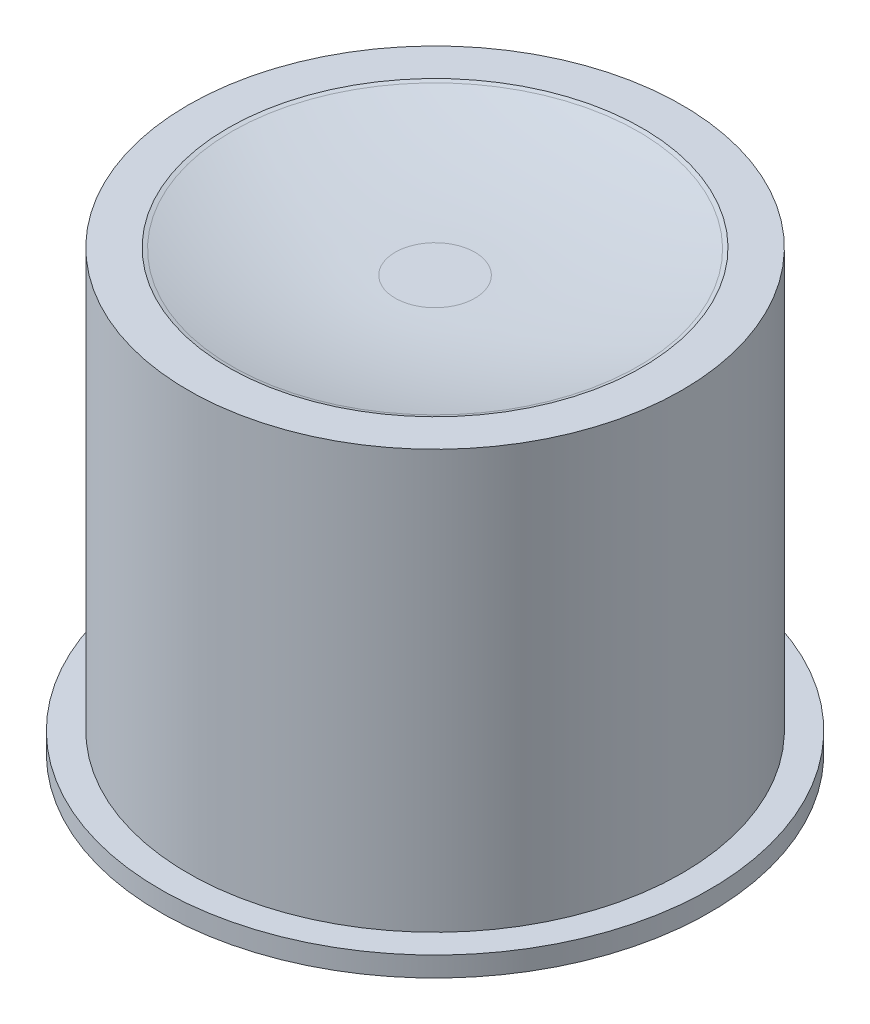
ISO-10303-21;
HEADER;
FILE_DESCRIPTION(('STEP AP214'),'2;1');
FILE_NAME('part.step','',(''),(''),'','','');
FILE_SCHEMA(('AUTOMOTIVE_DESIGN { 1 0 10303 214 1 1 1 1 }'));
ENDSEC;
DATA;
#1=APPLICATION_CONTEXT('core data for automotive mechanical design processes');
#2=APPLICATION_PROTOCOL_DEFINITION('international standard','automotive_design',2000,#1);
#3=PRODUCT_CONTEXT('',#1,'mechanical');
#4=PRODUCT('Part','Part','',(#3));
#5=PRODUCT_RELATED_PRODUCT_CATEGORY('part','',(#4));
#6=PRODUCT_DEFINITION_FORMATION('','',#4);
#7=PRODUCT_DEFINITION_CONTEXT('part definition',#1,'design');
#8=PRODUCT_DEFINITION('design','',#6,#7);
#9=PRODUCT_DEFINITION_SHAPE('','',#8);
#10=(LENGTH_UNIT() NAMED_UNIT(*) SI_UNIT(.MILLI.,.METRE.));
#11=(NAMED_UNIT(*) PLANE_ANGLE_UNIT() SI_UNIT($,.RADIAN.));
#12=(NAMED_UNIT(*) SI_UNIT($,.STERADIAN.) SOLID_ANGLE_UNIT());
#13=UNCERTAINTY_MEASURE_WITH_UNIT(LENGTH_MEASURE(1.E-05),#10,'distance_accuracy_value','');
#14=(GEOMETRIC_REPRESENTATION_CONTEXT(3) GLOBAL_UNCERTAINTY_ASSIGNED_CONTEXT((#13)) GLOBAL_UNIT_ASSIGNED_CONTEXT((#10,
#11,#12)) REPRESENTATION_CONTEXT('',''));
#15=CARTESIAN_POINT('',(0.,0.,0.));
#16=DIRECTION('',(0.,0.,1.));
#17=DIRECTION('',(1.,0.,0.));
#18=AXIS2_PLACEMENT_3D('',#15,#16,#17);
#19=CARTESIAN_POINT('',(0.,11.4003472180361,0.));
#20=DIRECTION('',(0.,1.,0.));
#21=DIRECTION('',(-1.,0.,0.));
#22=AXIS2_PLACEMENT_3D('',#19,#20,#21);
#23=PLANE('',#22);
#24=CARTESIAN_POINT('',(0.,11.4003472180361,0.));
#25=DIRECTION('',(0.,1.,0.));
#26=DIRECTION('',(-1.,0.,0.));
#27=AXIS2_PLACEMENT_3D('',#24,#25,#26);
#28=CIRCLE('',#27,0.999999999999999);
#29=CARTESIAN_POINT('',(-1.,11.4003472180361,0.));
#30=VERTEX_POINT('',#29);
#31=EDGE_CURVE('E76',#30,#30,#28,.T.);
#32=ORIENTED_EDGE('',*,*,#31,.T.);
#33=EDGE_LOOP('',(#32));
#34=FACE_BOUND('',#33,.T.);
#35=ADVANCED_FACE('F37',(#34),#23,.T.);
#36=CARTESIAN_POINT('',(-1.5,0.,0.));
#37=DIRECTION('',(0.,-1.,0.));
#38=DIRECTION('',(1.,0.,0.));
#39=AXIS2_PLACEMENT_3D('',#36,#37,#38);
#40=PLANE('',#39);
#41=CARTESIAN_POINT('',(0.,0.,0.));
#42=DIRECTION('',(0.,1.,0.));
#43=DIRECTION('',(-1.,0.,0.));
#44=AXIS2_PLACEMENT_3D('',#41,#42,#43);
#45=CIRCLE('',#44,1.5);
#46=CARTESIAN_POINT('',(-1.5,0.,0.));
#47=VERTEX_POINT('',#46);
#48=EDGE_CURVE('E10',#47,#47,#45,.T.);
#49=ORIENTED_EDGE('',*,*,#48,.F.);
#50=EDGE_LOOP('',(#49));
#51=FACE_BOUND('',#50,.T.);
#52=ADVANCED_FACE('F94',(#51),#40,.T.);
#53=CARTESIAN_POINT('',(0.,11.4003472180361,0.));
#54=DIRECTION('',(0.,1.,0.));
#55=DIRECTION('',(-1.,0.,0.));
#56=AXIS2_PLACEMENT_3D('',#53,#54,#55);
#57=CYLINDRICAL_SURFACE('',#56,1.5);
#58=ORIENTED_EDGE('',*,*,#48,.T.);
#59=EDGE_LOOP('',(#58));
#60=FACE_BOUND('',#59,.T.);
#61=CARTESIAN_POINT('',(0.,1.,0.));
#62=DIRECTION('',(0.,1.,0.));
#63=DIRECTION('',(-1.,0.,0.));
#64=AXIS2_PLACEMENT_3D('',#61,#62,#63);
#65=CIRCLE('',#64,1.5);
#66=CARTESIAN_POINT('',(-1.5,1.,0.));
#67=VERTEX_POINT('',#66);
#68=EDGE_CURVE('E44',#67,#67,#65,.T.);
#69=ORIENTED_EDGE('',*,*,#68,.F.);
#70=EDGE_LOOP('',(#69));
#71=FACE_BOUND('',#70,.T.);
#72=ADVANCED_FACE('F98',(#60,#71),#57,.T.);
#73=CARTESIAN_POINT('',(-6.2,1.,0.));
#74=DIRECTION('',(0.,-1.,0.));
#75=DIRECTION('',(1.,0.,0.));
#76=AXIS2_PLACEMENT_3D('',#73,#74,#75);
#77=PLANE('',#76);
#78=ORIENTED_EDGE('',*,*,#68,.T.);
#79=EDGE_LOOP('',(#78));
#80=FACE_BOUND('',#79,.T.);
#81=CARTESIAN_POINT('',(0.,1.,0.));
#82=DIRECTION('',(0.,1.,0.));
#83=DIRECTION('',(-1.,0.,0.));
#84=AXIS2_PLACEMENT_3D('',#81,#82,#83);
#85=CIRCLE('',#84,6.9);
#86=CARTESIAN_POINT('',(-6.9,1.,0.));
#87=VERTEX_POINT('',#86);
#88=EDGE_CURVE('E49',#87,#87,#85,.T.);
#89=ORIENTED_EDGE('',*,*,#88,.F.);
#90=EDGE_LOOP('',(#89));
#91=FACE_BOUND('',#90,.T.);
#92=ADVANCED_FACE('F103',(#80,#91),#77,.T.);
#93=CARTESIAN_POINT('',(0.,11.4003472180361,0.));
#94=DIRECTION('',(0.,1.,0.));
#95=DIRECTION('',(-1.,0.,0.));
#96=AXIS2_PLACEMENT_3D('',#93,#94,#95);
#97=CYLINDRICAL_SURFACE('',#96,6.9);
#98=ORIENTED_EDGE('',*,*,#88,.T.);
#99=EDGE_LOOP('',(#98));
#100=FACE_BOUND('',#99,.T.);
#101=CARTESIAN_POINT('',(0.,1.5,0.));
#102=DIRECTION('',(0.,1.,0.));
#103=DIRECTION('',(-1.,0.,0.));
#104=AXIS2_PLACEMENT_3D('',#101,#102,#103);
#105=CIRCLE('',#104,6.9);
#106=CARTESIAN_POINT('',(-6.9,1.5,0.));
#107=VERTEX_POINT('',#106);
#108=EDGE_CURVE('E54',#107,#107,#105,.T.);
#109=ORIENTED_EDGE('',*,*,#108,.F.);
#110=EDGE_LOOP('',(#109));
#111=FACE_BOUND('',#110,.T.);
#112=ADVANCED_FACE('F108',(#100,#111),#97,.T.);
#113=CARTESIAN_POINT('',(-6.9,1.5,0.));
#114=DIRECTION('',(0.,1.,0.));
#115=DIRECTION('',(-1.,0.,0.));
#116=AXIS2_PLACEMENT_3D('',#113,#114,#115);
#117=PLANE('',#116);
#118=ORIENTED_EDGE('',*,*,#108,.T.);
#119=EDGE_LOOP('',(#118));
#120=FACE_BOUND('',#119,.T.);
#121=CARTESIAN_POINT('',(0.,1.5,0.));
#122=DIRECTION('',(0.,1.,0.));
#123=DIRECTION('',(-1.,0.,0.));
#124=AXIS2_PLACEMENT_3D('',#121,#122,#123);
#125=CIRCLE('',#124,6.2);
#126=CARTESIAN_POINT('',(-6.2,1.5,0.));
#127=VERTEX_POINT('',#126);
#128=EDGE_CURVE('E60',#127,#127,#125,.T.);
#129=ORIENTED_EDGE('',*,*,#128,.F.);
#130=EDGE_LOOP('',(#129));
#131=FACE_BOUND('',#130,.T.);
#132=ADVANCED_FACE('F111',(#120,#131),#117,.T.);
#133=CARTESIAN_POINT('',(0.,11.4003472180361,0.));
#134=DIRECTION('',(0.,1.,0.));
#135=DIRECTION('',(-1.,0.,0.));
#136=AXIS2_PLACEMENT_3D('',#133,#134,#135);
#137=CYLINDRICAL_SURFACE('',#136,6.2);
#138=ORIENTED_EDGE('',*,*,#128,.T.);
#139=EDGE_LOOP('',(#138));
#140=FACE_BOUND('',#139,.T.);
#141=CARTESIAN_POINT('',(0.,12.,0.));
#142=DIRECTION('',(0.,1.,0.));
#143=DIRECTION('',(-1.,0.,0.));
#144=AXIS2_PLACEMENT_3D('',#141,#142,#143);
#145=CIRCLE('',#144,6.2);
#146=CARTESIAN_POINT('',(-6.2,12.,0.));
#147=VERTEX_POINT('',#146);
#148=EDGE_CURVE('E64',#147,#147,#145,.T.);
#149=ORIENTED_EDGE('',*,*,#148,.F.);
#150=EDGE_LOOP('',(#149));
#151=FACE_BOUND('',#150,.T.);
#152=ADVANCED_FACE('F115',(#140,#151),#137,.T.);
#153=CARTESIAN_POINT('',(-5.2,12.,0.));
#154=DIRECTION('',(0.,1.,0.));
#155=DIRECTION('',(-1.,0.,0.));
#156=AXIS2_PLACEMENT_3D('',#153,#154,#155);
#157=PLANE('',#156);
#158=ORIENTED_EDGE('',*,*,#148,.T.);
#159=EDGE_LOOP('',(#158));
#160=FACE_BOUND('',#159,.T.);
#161=CARTESIAN_POINT('',(0.,12.,0.));
#162=DIRECTION('',(0.,1.,0.));
#163=DIRECTION('',(-1.,0.,0.));
#164=AXIS2_PLACEMENT_3D('',#161,#162,#163);
#165=CIRCLE('',#164,5.2);
#166=CARTESIAN_POINT('',(-5.2,12.,0.));
#167=VERTEX_POINT('',#166);
#168=EDGE_CURVE('E68',#167,#167,#165,.T.);
#169=ORIENTED_EDGE('',*,*,#168,.F.);
#170=EDGE_LOOP('',(#169));
#171=FACE_BOUND('',#170,.T.);
#172=ADVANCED_FACE('F90',(#160,#171),#157,.T.);
#173=CARTESIAN_POINT('',(0.,11.9726412313772,0.));
#174=DIRECTION('',(0.,1.,0.));
#175=DIRECTION('',(-1.,0.,0.));
#176=AXIS2_PLACEMENT_3D('',#173,#174,#175);
#177=CONICAL_SURFACE('',#176,5.10381529342228,1.29367526674976);
#178=ORIENTED_EDGE('',*,*,#168,.T.);
#179=EDGE_LOOP('',(#178));
#180=FACE_BOUND('',#179,.T.);
#181=CARTESIAN_POINT('',(0.,11.9726412313772,0.));
#182=DIRECTION('',(0.,1.,0.));
#183=DIRECTION('',(-1.,0.,0.));
#184=AXIS2_PLACEMENT_3D('',#181,#182,#183);
#185=CIRCLE('',#184,5.10381529342228);
#186=CARTESIAN_POINT('',(-5.10381529342228,11.9726412313772,0.));
#187=VERTEX_POINT('',#186);
#188=EDGE_CURVE('E72',#187,#187,#185,.T.);
#189=ORIENTED_EDGE('',*,*,#188,.F.);
#190=EDGE_LOOP('',(#189));
#191=FACE_BOUND('',#190,.T.);
#192=ADVANCED_FACE('F84',(#180,#191),#177,.F.);
#193=CARTESIAN_POINT('',(0.,26.4003472180361,0.));
#194=DIRECTION('',(0.,1.,0.));
#195=DIRECTION('',(-1.,0.,0.));
#196=AXIS2_PLACEMENT_3D('',#193,#194,#195);
#197=DEGENERATE_TOROIDAL_SURFACE('',#196,0.999999999999994,15.,.T.);
#198=ORIENTED_EDGE('',*,*,#188,.T.);
#199=EDGE_LOOP('',(#198));
#200=FACE_BOUND('',#199,.T.);
#201=ORIENTED_EDGE('',*,*,#31,.F.);
#202=EDGE_LOOP('',(#201));
#203=FACE_BOUND('',#202,.T.);
#204=ADVANCED_FACE('F82',(#200,#203),#197,.F.);
#205=CLOSED_SHELL('',(#35,#52,#72,#92,#112,#132,#152,#172,#192,#204));
#206=MANIFOLD_SOLID_BREP('B2',#205);
#207=ADVANCED_BREP_SHAPE_REPRESENTATION('',(#18,#206),#14);
#208=SHAPE_DEFINITION_REPRESENTATION(#9,#207);
ENDSEC;
END-ISO-10303-21;
